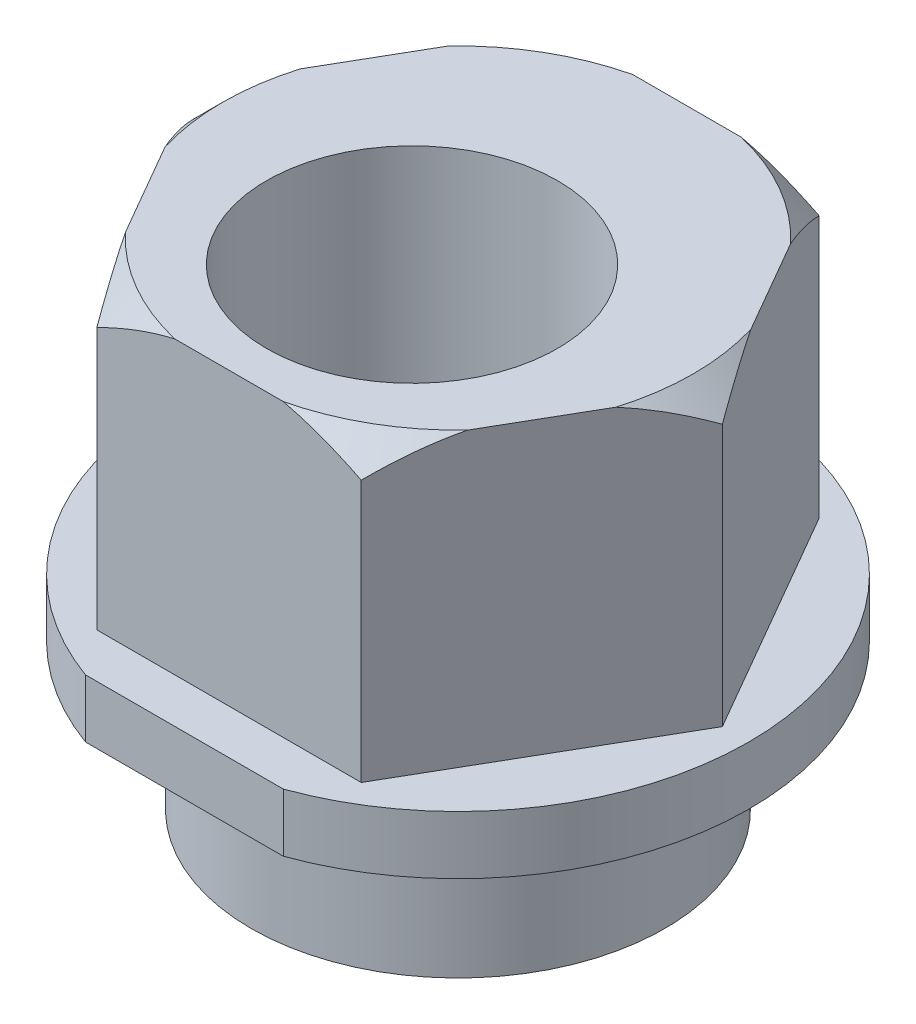
ISO-10303-21;
HEADER;
FILE_DESCRIPTION(('STEP AP214'),'2;1');
FILE_NAME('part.step','',(''),(''),'','','');
FILE_SCHEMA(('AUTOMOTIVE_DESIGN { 1 0 10303 214 1 1 1 1 }'));
ENDSEC;
DATA;
#1=APPLICATION_CONTEXT('core data for automotive mechanical design processes');
#2=APPLICATION_PROTOCOL_DEFINITION('international standard','automotive_design',2000,#1);
#3=PRODUCT_CONTEXT('',#1,'mechanical');
#4=PRODUCT('Part','Part','',(#3));
#5=PRODUCT_RELATED_PRODUCT_CATEGORY('part','',(#4));
#6=PRODUCT_DEFINITION_FORMATION('','',#4);
#7=PRODUCT_DEFINITION_CONTEXT('part definition',#1,'design');
#8=PRODUCT_DEFINITION('design','',#6,#7);
#9=PRODUCT_DEFINITION_SHAPE('','',#8);
#10=(LENGTH_UNIT() NAMED_UNIT(*) SI_UNIT(.MILLI.,.METRE.));
#11=(NAMED_UNIT(*) PLANE_ANGLE_UNIT() SI_UNIT($,.RADIAN.));
#12=(NAMED_UNIT(*) SI_UNIT($,.STERADIAN.) SOLID_ANGLE_UNIT());
#13=UNCERTAINTY_MEASURE_WITH_UNIT(LENGTH_MEASURE(1.E-05),#10,'distance_accuracy_value','');
#14=(GEOMETRIC_REPRESENTATION_CONTEXT(3) GLOBAL_UNCERTAINTY_ASSIGNED_CONTEXT((#13)) GLOBAL_UNIT_ASSIGNED_CONTEXT((#10,
#11,#12)) REPRESENTATION_CONTEXT('',''));
#15=CARTESIAN_POINT('',(0.,0.,0.));
#16=DIRECTION('',(0.,0.,1.));
#17=DIRECTION('',(1.,0.,0.));
#18=AXIS2_PLACEMENT_3D('',#15,#16,#17);
#19=CARTESIAN_POINT('',(0.,-1.,0.));
#20=DIRECTION('',(0.,1.,0.));
#21=DIRECTION('',(0.,0.,1.));
#22=AXIS2_PLACEMENT_3D('',#19,#20,#21);
#23=PLANE('',#22);
#24=CARTESIAN_POINT('',(0.,-1.,0.));
#25=DIRECTION('',(0.,1.,0.));
#26=DIRECTION('',(0.,0.,1.));
#27=AXIS2_PLACEMENT_3D('',#24,#25,#26);
#28=CIRCLE('',#27,5.);
#29=CARTESIAN_POINT('',(1.7,-1.,4.7021271782035));
#30=VERTEX_POINT('',#29);
#31=CARTESIAN_POINT('',(-1.7,-1.,4.7021271782035));
#32=VERTEX_POINT('',#31);
#33=EDGE_CURVE('E223',#30,#32,#28,.T.);
#34=ORIENTED_EDGE('',*,*,#33,.F.);
#35=DIRECTION('',(-1.,0.,0.));
#36=VECTOR('',#35,1.);
#37=CARTESIAN_POINT('',(0.,-1.,4.7021271782035));
#38=LINE('',#37,#36);
#39=EDGE_CURVE('E338',#30,#32,#38,.T.);
#40=ORIENTED_EDGE('',*,*,#39,.T.);
#41=EDGE_LOOP('',(#34,#40));
#42=FACE_BOUND('',#41,.T.);
#43=CARTESIAN_POINT('',(0.,-1.,0.));
#44=DIRECTION('',(0.,1.,0.));
#45=DIRECTION('',(0.,0.,1.));
#46=AXIS2_PLACEMENT_3D('',#43,#44,#45);
#47=CIRCLE('',#46,3.555);
#48=CARTESIAN_POINT('',(0.,-1.,3.555));
#49=VERTEX_POINT('',#48);
#50=EDGE_CURVE('E168',#49,#49,#47,.F.);
#51=ORIENTED_EDGE('',*,*,#50,.F.);
#52=EDGE_LOOP('',(#51));
#53=FACE_BOUND('',#52,.T.);
#54=ADVANCED_FACE('F36',(#42,#53),#23,.F.);
#55=CARTESIAN_POINT('',(2.27187330926118,5.,3.935));
#56=DIRECTION('',(-0.866025403784439,0.,-0.5));
#57=DIRECTION('',(-0.5,0.,0.866025403784439));
#58=AXIS2_PLACEMENT_3D('',#55,#56,#57);
#59=PLANE('',#58);
#60=DIRECTION('',(0.,-1.,0.));
#61=VECTOR('',#60,1.);
#62=CARTESIAN_POINT('',(4.54374661852235,5.,0.));
#63=LINE('',#62,#61);
#64=CARTESIAN_POINT('',(4.54374661852235,4.5,0.));
#65=VERTEX_POINT('',#64);
#66=CARTESIAN_POINT('',(4.54374661852235,0.,0.));
#67=VERTEX_POINT('',#66);
#68=EDGE_CURVE('E165',#65,#67,#63,.T.);
#69=ORIENTED_EDGE('',*,*,#68,.F.);
#70=CARTESIAN_POINT('',(6.12736327266163,2.33046829888115,-2.74290450468147));
#71=CARTESIAN_POINT('',(6.07348339276709,2.4177650828994,-2.64958181519841));
#72=CARTESIAN_POINT('',(6.01938921555573,2.50453762285222,-2.55588795187471));
#73=CARTESIAN_POINT('',(5.91069789973588,2.67683309661582,-2.36762907053321));
#74=CARTESIAN_POINT('',(5.85610071578471,2.76235591593962,-2.27306397397959));
#75=CARTESIAN_POINT('',(5.74620735938589,2.9321379387506,-2.08272309728255));
#76=CARTESIAN_POINT('',(5.6909098259844,3.01639362513631,-1.98694495989795));
#77=CARTESIAN_POINT('',(5.57966030231228,3.18315508159383,-1.79425513258));
#78=CARTESIAN_POINT('',(5.52370832991605,3.26566089928668,-1.69734347360602));
#79=CARTESIAN_POINT('',(5.40948255505868,3.43085092459455,-1.49949862801914));
#80=CARTESIAN_POINT('',(5.3511874452437,3.51347634106705,-1.3985285359868));
#81=CARTESIAN_POINT('',(5.23367321649109,3.67605365317037,-1.194987921175));
#82=CARTESIAN_POINT('',(5.17445413325307,3.75600565172091,-1.09241746022911));
#83=CARTESIAN_POINT('',(5.05499257757878,3.9125743398257,-0.885503976250002));
#84=CARTESIAN_POINT('',(4.99475102957391,3.98919384008597,-0.78116255437897));
#85=CARTESIAN_POINT('',(4.873034492307,4.1383918042904,-0.570343327711337));
#86=CARTESIAN_POINT('',(4.81155966257741,4.21097078637303,-0.463865799233039));
#87=CARTESIAN_POINT('',(4.68581480841085,4.35265115676022,-0.246069323026223));
#88=CARTESIAN_POINT('',(4.62151303943029,4.42164059850529,-0.134695392135335));
#89=CARTESIAN_POINT('',(4.4912183922476,4.55301635986169,0.090981556739347));
#90=CARTESIAN_POINT('',(4.42522527529575,4.61540174079966,0.205284988249787));
#91=CARTESIAN_POINT('',(4.29176890522431,4.73150823576122,0.436438201807242));
#92=CARTESIAN_POINT('',(4.22431561588303,4.78527468558276,0.553270726083977));
#93=CARTESIAN_POINT('',(4.08756303909753,4.88247623364584,0.790133137142428));
#94=CARTESIAN_POINT('',(4.01826431274338,4.92591443311341,0.910162052087628));
#95=CARTESIAN_POINT('',(3.89160680975576,4.99299560676046,1.129539282422));
#96=CARTESIAN_POINT('',(3.83454175212893,5.01884439579798,1.22837886156851));
#97=CARTESIAN_POINT('',(3.71955042243969,5.06126068823275,1.42754968702018));
#98=CARTESIAN_POINT('',(3.66162427680432,5.0778295405829,1.52788071434728));
#99=CARTESIAN_POINT('',(3.54536540774452,5.10083438466152,1.72924698238935));
#100=CARTESIAN_POINT('',(3.4870335640049,5.1072879053957,1.83028069944554));
#101=CARTESIAN_POINT('',(3.37031281221754,5.10976287991731,2.03244697183888));
#102=CARTESIAN_POINT('',(3.31192390350574,5.10578421082689,2.13357952832621));
#103=CARTESIAN_POINT('',(3.19571069696838,5.08764038060559,2.33486670655941));
#104=CARTESIAN_POINT('',(3.13788528988516,5.07350318473267,2.43502324959591));
#105=CARTESIAN_POINT('',(3.02300572590152,5.03579603444199,2.63400049116693));
#106=CARTESIAN_POINT('',(2.96595175572664,5.01222383709666,2.73282086628335));
#107=CARTESIAN_POINT('',(2.85271904802042,4.95661618256865,2.9289456691091));
#108=CARTESIAN_POINT('',(2.79654337792266,4.92455603960202,3.02624478386765));
#109=CARTESIAN_POINT('',(2.68537248742994,4.85318593152667,3.21879841452373));
#110=CARTESIAN_POINT('',(2.63037720983353,4.81387631861451,3.31405302949706));
#111=CARTESIAN_POINT('',(2.5019161833033,4.71383121159169,3.53655405423988));
#112=CARTESIAN_POINT('',(2.42896022795634,4.65048731772351,3.66291747561553));
#113=CARTESIAN_POINT('',(2.28511505424096,4.51496245516658,3.91206462491415));
#114=CARTESIAN_POINT('',(2.2142269607044,4.44277678394606,4.03484640457117));
#115=CARTESIAN_POINT('',(2.07416708594693,4.29140781010891,4.27743722375284));
#116=CARTESIAN_POINT('',(2.00499919286836,4.21221022636325,4.39723952881742));
#117=CARTESIAN_POINT('',(1.86828970424628,4.04847541244671,4.63402730898762));
#118=CARTESIAN_POINT('',(1.80074782327538,3.96393912900212,4.75101327846797));
#119=CARTESIAN_POINT('',(1.6667324101583,3.790255628053,4.9831347829841));
#120=CARTESIAN_POINT('',(1.60026513983173,3.70108917509827,5.09825947223014));
#121=CARTESIAN_POINT('',(1.46849790545969,3.51936003005431,5.32648701693534));
#122=CARTESIAN_POINT('',(1.40319803917282,3.42679705550268,5.43958970307165));
#123=CARTESIAN_POINT('',(1.27366225353528,3.23904020589262,5.66395226519422));
#124=CARTESIAN_POINT('',(1.20942525212282,3.14384930831284,5.77521401536649));
#125=CARTESIAN_POINT('',(1.08179181966025,2.9512386314917,5.99628160513605));
#126=CARTESIAN_POINT('',(1.01839540535985,2.85381880794148,6.10608741572204));
#127=CARTESIAN_POINT('',(0.910409016945997,2.6853578347565,6.2931253269807));
#128=CARTESIAN_POINT('',(0.865642352807006,2.61476846228915,6.3706634637548));
#129=CARTESIAN_POINT('',(0.776622094234247,2.47305833440251,6.52485107450574));
#130=CARTESIAN_POINT('',(0.732367142810404,2.40194099006958,6.60150289885833));
#131=CARTESIAN_POINT('',(0.688256655121896,2.33046829888115,6.67790450468147));
#132=B_SPLINE_CURVE_WITH_KNOTS('',3,(#70,#71,#72,#73,#74,#75,#76,#77,#78,#79,#80,#81,#82,#83,
#84,#85,#86,#87,#88,#89,#90,#91,#92,#93,#94,#95,#96,#97,#98,#99,#100,#101,#102,#103,#104,#105,
#106,#107,#108,#109,#110,#111,#112,#113,#114,#115,#116,#117,#118,#119,#120,#121,#122,#123,#124,
#125,#126,#127,#128,#129,#130,#131),.UNSPECIFIED.,.F.,.F.,(4,2,2,2,2,2,2,2,2,2,2,2,2,2,2,2,2,2,
2,2,2,2,2,2,2,2,2,2,2,2,4),(0.,0.416050988652375,0.832139855784054,1.24922530063749,
1.6662993802975,2.09496685038955,2.52361779884089,2.95189991005181,3.38012697311563,
3.81779500231414,4.25552515650994,4.69087140580247,5.12608676971888,5.4768138337239,
5.82748990199696,6.17755760407587,6.52762942952254,6.87674122143841,7.22593605499141,
7.5761578380004,7.92636261087879,8.40316579002672,8.88022366888807,9.35827656071276,
9.83624491486482,10.316388748245,10.7965726023688,11.2762330860941,11.7559031133002,
12.0979389750605,12.4385584137849),.UNSPECIFIED.);
#133=CARTESIAN_POINT('',(3.87355176865353,5.,1.1608115309438));
#134=VERTEX_POINT('',#133);
#135=EDGE_CURVE('E315',#65,#134,#132,.T.);
#136=ORIENTED_EDGE('',*,*,#135,.T.);
#137=DIRECTION('',(0.5,0.,-0.866025403784439));
#138=VECTOR('',#137,1.);
#139=CARTESIAN_POINT('',(2.27187330926118,5.,3.935));
#140=LINE('',#139,#138);
#141=CARTESIAN_POINT('',(2.94206815913,5.,2.7741884690562));
#142=VERTEX_POINT('',#141);
#143=EDGE_CURVE('E235',#142,#134,#140,.T.);
#144=ORIENTED_EDGE('',*,*,#143,.F.);
#145=CARTESIAN_POINT('',(2.27187330926118,4.5,3.935));
#146=VERTEX_POINT('',#145);
#147=EDGE_CURVE('E252',#142,#146,#132,.T.);
#148=ORIENTED_EDGE('',*,*,#147,.T.);
#149=DIRECTION('',(0.,-1.,0.));
#150=VECTOR('',#149,1.);
#151=CARTESIAN_POINT('',(2.27187330926118,5.,3.935));
#152=LINE('',#151,#150);
#153=CARTESIAN_POINT('',(2.27187330926118,0.,3.935));
#154=VERTEX_POINT('',#153);
#155=EDGE_CURVE('E219',#146,#154,#152,.T.);
#156=ORIENTED_EDGE('',*,*,#155,.T.);
#157=DIRECTION('',(0.5,0.,-0.866025403784439));
#158=VECTOR('',#157,1.);
#159=CARTESIAN_POINT('',(2.27187330926118,0.,3.935));
#160=LINE('',#159,#158);
#161=EDGE_CURVE('E220',#154,#67,#160,.T.);
#162=ORIENTED_EDGE('',*,*,#161,.T.);
#163=EDGE_LOOP('',(#69,#136,#144,#148,#156,#162));
#164=FACE_BOUND('',#163,.T.);
#165=ADVANCED_FACE('F38',(#164),#59,.F.);
#166=CARTESIAN_POINT('',(4.54374661852235,5.,0.));
#167=DIRECTION('',(-0.866025403784438,0.,0.5));
#168=DIRECTION('',(0.5,0.,0.866025403784438));
#169=AXIS2_PLACEMENT_3D('',#166,#167,#168);
#170=PLANE('',#169);
#171=DIRECTION('',(0.,-1.,0.));
#172=VECTOR('',#171,1.);
#173=CARTESIAN_POINT('',(2.27187330926118,5.,-3.935));
#174=LINE('',#173,#172);
#175=CARTESIAN_POINT('',(2.27187330926118,4.5,-3.935));
#176=VERTEX_POINT('',#175);
#177=CARTESIAN_POINT('',(2.27187330926118,0.,-3.935));
#178=VERTEX_POINT('',#177);
#179=EDGE_CURVE('E154',#176,#178,#174,.T.);
#180=ORIENTED_EDGE('',*,*,#179,.F.);
#181=CARTESIAN_POINT('',(0.688256655121894,2.33046829888116,-6.67790450468146));
#182=CARTESIAN_POINT('',(0.742136535016436,2.4177650828994,-6.58458181519841));
#183=CARTESIAN_POINT('',(0.796230712227795,2.50453762285222,-6.4908879518747));
#184=CARTESIAN_POINT('',(0.904922028047648,2.67683309661582,-6.3026290705332));
#185=CARTESIAN_POINT('',(0.959519211998818,2.76235591593963,-6.20806397397959));
#186=CARTESIAN_POINT('',(1.06941256839764,2.93213793875061,-6.01772309728255));
#187=CARTESIAN_POINT('',(1.12471010179913,3.01639362513632,-5.92194495989794));
#188=CARTESIAN_POINT('',(1.23595962547125,3.18315508159383,-5.72925513257999));
#189=CARTESIAN_POINT('',(1.29191159786749,3.26566089928668,-5.63234347360602));
#190=CARTESIAN_POINT('',(1.40613737272485,3.43085092459456,-5.43449862801913));
#191=CARTESIAN_POINT('',(1.46443248253983,3.51347634106706,-5.33352853598679));
#192=CARTESIAN_POINT('',(1.58194671129244,3.67605365317038,-5.12998792117499));
#193=CARTESIAN_POINT('',(1.64116579453046,3.75600565172092,-5.0274174602291));
#194=CARTESIAN_POINT('',(1.76062735020476,3.9125743398257,-4.82050397624999));
#195=CARTESIAN_POINT('',(1.82086889820963,3.98919384008598,-4.71616255437896));
#196=CARTESIAN_POINT('',(1.94258543547653,4.1383918042904,-4.50534332771133));
#197=CARTESIAN_POINT('',(2.00406026520612,4.21097078637303,-4.39886579923303));
#198=CARTESIAN_POINT('',(2.12980511937268,4.35265115676022,-4.18106932302621));
#199=CARTESIAN_POINT('',(2.19410688835324,4.4216405985053,-4.06969539213533));
#200=CARTESIAN_POINT('',(2.32440153553593,4.5530163598617,-3.84401844326064));
#201=CARTESIAN_POINT('',(2.39039465248778,4.61540174079966,-3.7297150117502));
#202=CARTESIAN_POINT('',(2.52385102255923,4.73150823576123,-3.49856179819275));
#203=CARTESIAN_POINT('',(2.5913043119005,4.78527468558276,-3.38172927391602));
#204=CARTESIAN_POINT('',(2.728056888686,4.88247623364584,-3.14486686285757));
#205=CARTESIAN_POINT('',(2.79735561504015,4.92591443311342,-3.02483794791237));
#206=CARTESIAN_POINT('',(2.92401311802778,4.99299560676046,-2.805460717578));
#207=CARTESIAN_POINT('',(2.98107817565461,5.01884439579799,-2.70662113843148));
#208=CARTESIAN_POINT('',(3.09606950534385,5.06126068823276,-2.50745031297981));
#209=CARTESIAN_POINT('',(3.15399565097922,5.0778295405829,-2.40711928565272));
#210=CARTESIAN_POINT('',(3.27025452003902,5.10083438466152,-2.20575301761065));
#211=CARTESIAN_POINT('',(3.32858636377864,5.1072879053957,-2.10471930055446));
#212=CARTESIAN_POINT('',(3.445307115566,5.10976287991731,-1.90255302816112));
#213=CARTESIAN_POINT('',(3.50369602427779,5.10578421082689,-1.80142047167379));
#214=CARTESIAN_POINT('',(3.61990923081515,5.08764038060559,-1.60013329344058));
#215=CARTESIAN_POINT('',(3.67773463789837,5.07350318473267,-1.49997675040409));
#216=CARTESIAN_POINT('',(3.79261420188202,5.03579603444199,-1.30099950883306));
#217=CARTESIAN_POINT('',(3.8496681720569,5.01222383709666,-1.20217913371665));
#218=CARTESIAN_POINT('',(3.96290087976311,4.95661618256865,-1.00605433089089));
#219=CARTESIAN_POINT('',(4.01907654986087,4.92455603960202,-0.908755216132345));
#220=CARTESIAN_POINT('',(4.13024744035359,4.85318593152667,-0.716201585476272));
#221=CARTESIAN_POINT('',(4.18524271795,4.81387631861451,-0.620946970502936));
#222=CARTESIAN_POINT('',(4.31370374448024,4.71383121159169,-0.398445945760117));
#223=CARTESIAN_POINT('',(4.38665969982719,4.6504873177235,-0.272082524384468));
#224=CARTESIAN_POINT('',(4.53050487354258,4.51496245516658,-0.0229353750858439));
#225=CARTESIAN_POINT('',(4.60139296707914,4.44277678394605,0.0998464045711766));
#226=CARTESIAN_POINT('',(4.74145284183661,4.2914078101089,0.342437223752842));
#227=CARTESIAN_POINT('',(4.81062073491518,4.21221022636324,0.462239528817422));
#228=CARTESIAN_POINT('',(4.94733022353726,4.0484754124467,0.699027308987622));
#229=CARTESIAN_POINT('',(5.01487210450815,3.96393912900211,0.81601327846798));
#230=CARTESIAN_POINT('',(5.14888751762524,3.79025562805299,1.04813478298411));
#231=CARTESIAN_POINT('',(5.21535478795181,3.70108917509827,1.16325947223014));
#232=CARTESIAN_POINT('',(5.34712202232385,3.5193600300543,1.39148701693534));
#233=CARTESIAN_POINT('',(5.41242188861072,3.42679705550267,1.50458970307166));
#234=CARTESIAN_POINT('',(5.54195767424825,3.23904020589262,1.72895226519422));
#235=CARTESIAN_POINT('',(5.60619467566072,3.14384930831283,1.84021401536649));
#236=CARTESIAN_POINT('',(5.73382810812329,2.95123863149169,2.06128160513606));
#237=CARTESIAN_POINT('',(5.79722452242369,2.85381880794147,2.17108741572204));
#238=CARTESIAN_POINT('',(5.90521091083754,2.68535783475649,2.3581253269807));
#239=CARTESIAN_POINT('',(5.94997757497653,2.61476846228915,2.43566346375481));
#240=CARTESIAN_POINT('',(6.03899783354929,2.47305833440251,2.58985107450574));
#241=CARTESIAN_POINT('',(6.08325278497313,2.40194099006958,2.66650289885833));
#242=CARTESIAN_POINT('',(6.12736327266164,2.33046829888115,2.74290450468146));
#243=B_SPLINE_CURVE_WITH_KNOTS('',3,(#181,#182,#183,#184,#185,#186,#187,#188,#189,#190,#191,
#192,#193,#194,#195,#196,#197,#198,#199,#200,#201,#202,#203,#204,#205,#206,#207,#208,#209,#210,
#211,#212,#213,#214,#215,#216,#217,#218,#219,#220,#221,#222,#223,#224,#225,#226,#227,#228,#229,
#230,#231,#232,#233,#234,#235,#236,#237,#238,#239,#240,#241,#242),.UNSPECIFIED.,.F.,.F.,(4,2,2,
2,2,2,2,2,2,2,2,2,2,2,2,2,2,2,2,2,2,2,2,2,2,2,2,2,2,2,4),(0.,0.416050988652376,
0.832139855784055,1.24922530063749,1.66629938029751,2.09496685038956,2.5236177988409,
2.95189991005182,3.38012697311563,3.81779500231415,4.25552515650994,4.69087140580247,
5.12608676971889,5.4768138337239,5.82748990199696,6.17755760407587,6.52762942952254,
6.87674122143841,7.22593605499141,7.57615783800039,7.92636261087879,8.40316579002672,
8.88022366888807,9.35827656071276,9.83624491486482,10.316388748245,10.7965726023688,
11.2762330860941,11.7559031133002,12.0979389750605,12.4385584137849),.UNSPECIFIED.);
#244=CARTESIAN_POINT('',(2.94206815913,5.,-2.7741884690562));
#245=VERTEX_POINT('',#244);
#246=EDGE_CURVE('E137',#176,#245,#243,.T.);
#247=ORIENTED_EDGE('',*,*,#246,.T.);
#248=DIRECTION('',(-0.5,0.,-0.866025403784438));
#249=VECTOR('',#248,1.);
#250=CARTESIAN_POINT('',(4.54374661852235,5.,0.));
#251=LINE('',#250,#249);
#252=CARTESIAN_POINT('',(3.87355176865353,5.,-1.1608115309438));
#253=VERTEX_POINT('',#252);
#254=EDGE_CURVE('E213',#253,#245,#251,.T.);
#255=ORIENTED_EDGE('',*,*,#254,.F.);
#256=EDGE_CURVE('E147',#253,#65,#243,.T.);
#257=ORIENTED_EDGE('',*,*,#256,.T.);
#258=ORIENTED_EDGE('',*,*,#68,.T.);
#259=DIRECTION('',(-0.5,0.,-0.866025403784438));
#260=VECTOR('',#259,1.);
#261=CARTESIAN_POINT('',(4.54374661852235,0.,0.));
#262=LINE('',#261,#260);
#263=EDGE_CURVE('E164',#67,#178,#262,.T.);
#264=ORIENTED_EDGE('',*,*,#263,.T.);
#265=EDGE_LOOP('',(#180,#247,#255,#257,#258,#264));
#266=FACE_BOUND('',#265,.T.);
#267=ADVANCED_FACE('F162',(#266),#170,.F.);
#268=CARTESIAN_POINT('',(2.27187330926118,5.,-3.935));
#269=DIRECTION('',(0.,0.,1.));
#270=DIRECTION('',(1.,0.,0.));
#271=AXIS2_PLACEMENT_3D('',#268,#269,#270);
#272=PLANE('',#271);
#273=DIRECTION('',(0.,-1.,0.));
#274=VECTOR('',#273,1.);
#275=CARTESIAN_POINT('',(-2.27187330926118,5.,-3.935));
#276=LINE('',#275,#274);
#277=CARTESIAN_POINT('',(-2.27187330926118,4.5,-3.935));
#278=VERTEX_POINT('',#277);
#279=CARTESIAN_POINT('',(-2.27187330926118,0.,-3.935));
#280=VERTEX_POINT('',#279);
#281=EDGE_CURVE('E166',#278,#280,#276,.T.);
#282=ORIENTED_EDGE('',*,*,#281,.F.);
#283=CARTESIAN_POINT('',(-5.01477781394264,2.6694057488158,-3.935));
#284=CARTESIAN_POINT('',(-4.90228240032233,2.75789162999437,-3.935));
#285=CARTESIAN_POINT('',(-4.78924605492269,2.84569863662638,-3.935));
#286=CARTESIAN_POINT('',(-4.56188241632701,3.01966288534844,-3.935));
#287=CARTESIAN_POINT('',(-4.44755491307628,3.10581985266844,-3.935));
#288=CARTESIAN_POINT('',(-4.21685222046402,3.27659538663721,-3.935));
#289=CARTESIAN_POINT('',(-4.10046957789372,3.36120391114583,-3.935));
#290=CARTESIAN_POINT('',(-3.86599418351296,3.52801066974508,-3.935));
#291=CARTESIAN_POINT('',(-3.74790151420127,3.61020901953759,-3.935));
#292=CARTESIAN_POINT('',(-3.50380543280417,3.77568927594522,-3.935));
#293=CARTESIAN_POINT('',(-3.3777005297054,3.85882204730453,-3.935));
#294=CARTESIAN_POINT('',(-3.12293409141574,4.0210686075328,-3.935));
#295=CARTESIAN_POINT('',(-2.99427277147477,4.10018273279293,-3.935));
#296=CARTESIAN_POINT('',(-2.7342134500717,4.25322326602883,-3.935));
#297=CARTESIAN_POINT('',(-2.60282112402671,4.32715926211431,-3.935));
#298=CARTESIAN_POINT('',(-2.33665993470769,4.46865096658867,-3.935));
#299=CARTESIAN_POINT('',(-2.20189200633557,4.53620841737975,-3.935));
#300=CARTESIAN_POINT('',(-1.94277039794665,4.65662539379787,-3.935));
#301=CARTESIAN_POINT('',(-1.81879024517606,4.7102827638368,-3.935));
#302=CARTESIAN_POINT('',(-1.56760322182998,4.80956431437058,-3.935));
#303=CARTESIAN_POINT('',(-1.4403960426367,4.8551877231961,-3.935));
#304=CARTESIAN_POINT('',(-1.18430895439847,4.93616339546024,-3.935));
#305=CARTESIAN_POINT('',(-1.05546474171029,4.97162701315895,-3.935));
#306=CARTESIAN_POINT('',(-0.795188728182397,5.03120060018271,-3.935));
#307=CARTESIAN_POINT('',(-0.663757985336443,5.05531511515621,-3.935));
#308=CARTESIAN_POINT('',(-0.39667530812576,5.09105643721047,-3.935));
#309=CARTESIAN_POINT('',(-0.260990364554486,5.10244193256667,-3.935));
#310=CARTESIAN_POINT('',(0.0108256286758382,5.11107629854814,-3.935));
#311=CARTESIAN_POINT('',(0.146956639108313,5.10832638056083,-3.935));
#312=CARTESIAN_POINT('',(0.418619878870053,5.08887050209526,-3.935));
#313=CARTESIAN_POINT('',(0.554148970208934,5.0721215602934,-3.935));
#314=CARTESIAN_POINT('',(0.822982454746628,5.02579152850102,-3.935));
#315=CARTESIAN_POINT('',(0.956286242224141,4.99620700199297,-3.935));
#316=CARTESIAN_POINT('',(1.26105655280132,4.91498323631563,-3.935));
#317=CARTESIAN_POINT('',(1.43144793684183,4.85934235740488,-3.935));
#318=CARTESIAN_POINT('',(1.76659971199313,4.73318715507506,-3.935));
#319=CARTESIAN_POINT('',(1.93135663408204,4.66266385383244,-3.935));
#320=CARTESIAN_POINT('',(2.25670464302017,4.50985567629177,-3.935));
#321=CARTESIAN_POINT('',(2.41725700907644,4.42748946751823,-3.935));
#322=CARTESIAN_POINT('',(2.7335996666453,4.25424890954647,-3.935));
#323=CARTESIAN_POINT('',(2.88939106725242,4.16337656225559,-3.935));
#324=CARTESIAN_POINT('',(3.2171018287942,3.96289685347115,-3.935));
#325=CARTESIAN_POINT('',(3.38846902004868,3.85239290462363,-3.935));
#326=CARTESIAN_POINT('',(3.7271209143155,3.62526903861077,-3.935));
#327=CARTESIAN_POINT('',(3.89440474117752,3.50864782550207,-3.935));
#328=CARTESIAN_POINT('',(4.22200861608271,3.27340163426143,-3.935));
#329=CARTESIAN_POINT('',(4.38240091884256,3.15487687320021,-3.935));
#330=CARTESIAN_POINT('',(4.6209837589724,2.97456068361506,-3.935));
#331=CARTESIAN_POINT('',(4.70015123515769,2.91405422097405,-3.935));
#332=CARTESIAN_POINT('',(4.85789331048121,2.79227931530866,-3.935));
#333=CARTESIAN_POINT('',(4.93646793238964,2.73101090179094,-3.935));
#334=CARTESIAN_POINT('',(5.01477781394264,2.6694057488158,-3.935));
#335=B_SPLINE_CURVE_WITH_KNOTS('',3,(#283,#284,#285,#286,#287,#288,#289,#290,#291,#292,#293,
#294,#295,#296,#297,#298,#299,#300,#301,#302,#303,#304,#305,#306,#307,#308,#309,#310,#311,#312,
#313,#314,#315,#316,#317,#318,#319,#320,#321,#322,#323,#324,#325,#326,#327,#328,#329,#330,#331,
#332,#333,#334),.UNSPECIFIED.,.F.,.F.,(4,2,2,2,2,2,2,2,2,2,2,2,2,2,2,2,2,2,2,2,2,2,2,2,2,4),(0.,
0.429382623340998,0.858836137877717,1.29047192805164,1.72208696325132,2.17515026344406,
2.62817557609088,3.08033856015113,3.53237766908385,3.9374314291705,4.34252407384557,
4.74299021725164,5.14329582542998,5.55106798246257,5.95880519450876,6.36779890408527,
6.77690218266532,7.31369645202257,7.85081547305105,8.39181700182992,8.932691525285,
9.54423171138721,10.15590197977,10.7541421331558,11.0530644250241,11.35197517691),.UNSPECIFIED.);
#336=CARTESIAN_POINT('',(-0.931483609523527,5.,-3.935));
#337=VERTEX_POINT('',#336);
#338=EDGE_CURVE('E159',#278,#337,#335,.T.);
#339=ORIENTED_EDGE('',*,*,#338,.T.);
#340=DIRECTION('',(-1.,0.,0.));
#341=VECTOR('',#340,1.);
#342=CARTESIAN_POINT('',(2.27187330926118,5.,-3.935));
#343=LINE('',#342,#341);
#344=CARTESIAN_POINT('',(0.931483609523526,5.,-3.935));
#345=VERTEX_POINT('',#344);
#346=EDGE_CURVE('E158',#345,#337,#343,.T.);
#347=ORIENTED_EDGE('',*,*,#346,.F.);
#348=EDGE_CURVE('E140',#345,#176,#335,.T.);
#349=ORIENTED_EDGE('',*,*,#348,.T.);
#350=ORIENTED_EDGE('',*,*,#179,.T.);
#351=DIRECTION('',(-1.,0.,0.));
#352=VECTOR('',#351,1.);
#353=CARTESIAN_POINT('',(2.27187330926118,0.,-3.935));
#354=LINE('',#353,#352);
#355=EDGE_CURVE('E225',#178,#280,#354,.T.);
#356=ORIENTED_EDGE('',*,*,#355,.T.);
#357=EDGE_LOOP('',(#282,#339,#347,#349,#350,#356));
#358=FACE_BOUND('',#357,.T.);
#359=ADVANCED_FACE('F152',(#358),#272,.F.);
#360=CARTESIAN_POINT('',(-2.27187330926118,5.,-3.935));
#361=DIRECTION('',(0.866025403784438,0.,0.5));
#362=DIRECTION('',(0.5,0.,-0.866025403784439));
#363=AXIS2_PLACEMENT_3D('',#360,#361,#362);
#364=PLANE('',#363);
#365=DIRECTION('',(0.,-1.,0.));
#366=VECTOR('',#365,1.);
#367=CARTESIAN_POINT('',(-4.54374661852235,5.,0.));
#368=LINE('',#367,#366);
#369=CARTESIAN_POINT('',(-4.54374661852235,4.5,0.));
#370=VERTEX_POINT('',#369);
#371=CARTESIAN_POINT('',(-4.54374661852235,0.,0.));
#372=VERTEX_POINT('',#371);
#373=EDGE_CURVE('E170',#370,#372,#368,.T.);
#374=ORIENTED_EDGE('',*,*,#373,.F.);
#375=CARTESIAN_POINT('',(-6.12736327266164,2.33046829888115,2.74290450468147));
#376=CARTESIAN_POINT('',(-6.07348339276709,2.4177650828994,2.64958181519841));
#377=CARTESIAN_POINT('',(-6.01938921555574,2.50453762285222,2.5558879518747));
#378=CARTESIAN_POINT('',(-5.91069789973588,2.67683309661582,2.3676290705332));
#379=CARTESIAN_POINT('',(-5.85610071578471,2.76235591593963,2.27306397397959));
#380=CARTESIAN_POINT('',(-5.74620735938589,2.9321379387506,2.08272309728255));
#381=CARTESIAN_POINT('',(-5.6909098259844,3.01639362513631,1.98694495989795));
#382=CARTESIAN_POINT('',(-5.57966030231228,3.18315508159383,1.79425513257999));
#383=CARTESIAN_POINT('',(-5.52370832991604,3.26566089928668,1.69734347360602));
#384=CARTESIAN_POINT('',(-5.40948255505868,3.43085092459455,1.49949862801913));
#385=CARTESIAN_POINT('',(-5.3511874452437,3.51347634106705,1.39852853598679));
#386=CARTESIAN_POINT('',(-5.23367321649109,3.67605365317037,1.19498792117499));
#387=CARTESIAN_POINT('',(-5.17445413325307,3.75600565172092,1.0924174602291));
#388=CARTESIAN_POINT('',(-5.05499257757878,3.9125743398257,0.885503976249998));
#389=CARTESIAN_POINT('',(-4.99475102957391,3.98919384008598,0.781162554378965));
#390=CARTESIAN_POINT('',(-4.873034492307,4.1383918042904,0.570343327711332));
#391=CARTESIAN_POINT('',(-4.81155966257741,4.21097078637303,0.463865799233036));
#392=CARTESIAN_POINT('',(-4.68581480841085,4.35265115676022,0.24606932302622));
#393=CARTESIAN_POINT('',(-4.62151303943029,4.42164059850529,0.134695392135332));
#394=CARTESIAN_POINT('',(-4.4912183922476,4.55301635986169,-0.0909815567393509));
#395=CARTESIAN_POINT('',(-4.42522527529575,4.61540174079966,-0.205284988249791));
#396=CARTESIAN_POINT('',(-4.2917689052243,4.73150823576122,-0.436438201807246));
#397=CARTESIAN_POINT('',(-4.22431561588303,4.78527468558276,-0.553270726083981));
#398=CARTESIAN_POINT('',(-4.08756303909753,4.88247623364584,-0.790133137142432));
#399=CARTESIAN_POINT('',(-4.01826431274338,4.92591443311341,-0.910162052087631));
#400=CARTESIAN_POINT('',(-3.89160680975576,4.99299560676046,-1.129539282422));
#401=CARTESIAN_POINT('',(-3.83454175212893,5.01884439579798,-1.22837886156851));
#402=CARTESIAN_POINT('',(-3.71955042243968,5.06126068823275,-1.42754968702018));
#403=CARTESIAN_POINT('',(-3.66162427680432,5.0778295405829,-1.52788071434728));
#404=CARTESIAN_POINT('',(-3.54536540774451,5.10083438466152,-1.72924698238935));
#405=CARTESIAN_POINT('',(-3.48703356400489,5.1072879053957,-1.83028069944554));
#406=CARTESIAN_POINT('',(-3.37031281221754,5.10976287991731,-2.03244697183888));
#407=CARTESIAN_POINT('',(-3.31192390350574,5.10578421082689,-2.13357952832621));
#408=CARTESIAN_POINT('',(-3.19571069696838,5.08764038060559,-2.33486670655941));
#409=CARTESIAN_POINT('',(-3.13788528988516,5.07350318473267,-2.43502324959591));
#410=CARTESIAN_POINT('',(-3.02300572590152,5.03579603444199,-2.63400049116693));
#411=CARTESIAN_POINT('',(-2.96595175572664,5.01222383709666,-2.73282086628335));
#412=CARTESIAN_POINT('',(-2.85271904802042,4.95661618256865,-2.9289456691091));
#413=CARTESIAN_POINT('',(-2.79654337792266,4.92455603960202,-3.02624478386765));
#414=CARTESIAN_POINT('',(-2.68537248742994,4.85318593152667,-3.21879841452372));
#415=CARTESIAN_POINT('',(-2.63037720983353,4.81387631861451,-3.31405302949706));
#416=CARTESIAN_POINT('',(-2.5019161833033,4.71383121159169,-3.53655405423988));
#417=CARTESIAN_POINT('',(-2.42896022795634,4.65048731772351,-3.66291747561553));
#418=CARTESIAN_POINT('',(-2.28511505424096,4.51496245516658,-3.91206462491415));
#419=CARTESIAN_POINT('',(-2.21422696070439,4.44277678394606,-4.03484640457117));
#420=CARTESIAN_POINT('',(-2.07416708594693,4.29140781010891,-4.27743722375283));
#421=CARTESIAN_POINT('',(-2.00499919286836,4.21221022636325,-4.39723952881741));
#422=CARTESIAN_POINT('',(-1.86828970424628,4.04847541244671,-4.63402730898761));
#423=CARTESIAN_POINT('',(-1.80074782327538,3.96393912900212,-4.75101327846797));
#424=CARTESIAN_POINT('',(-1.6667324101583,3.790255628053,-4.9831347829841));
#425=CARTESIAN_POINT('',(-1.60026513983173,3.70108917509828,-5.09825947223013));
#426=CARTESIAN_POINT('',(-1.46849790545969,3.51936003005432,-5.32648701693533));
#427=CARTESIAN_POINT('',(-1.40319803917282,3.42679705550269,-5.43958970307165));
#428=CARTESIAN_POINT('',(-1.27366225353529,3.23904020589263,-5.66395226519421));
#429=CARTESIAN_POINT('',(-1.20942525212282,3.14384930831284,-5.77521401536648));
#430=CARTESIAN_POINT('',(-1.08179181966026,2.95123863149171,-5.99628160513604));
#431=CARTESIAN_POINT('',(-1.01839540535985,2.85381880794148,-6.10608741572203));
#432=CARTESIAN_POINT('',(-0.910409016945998,2.68535783475651,-6.29312532698069));
#433=CARTESIAN_POINT('',(-0.865642352807006,2.61476846228916,-6.3706634637548));
#434=CARTESIAN_POINT('',(-0.776622094234247,2.47305833440251,-6.52485107450573));
#435=CARTESIAN_POINT('',(-0.732367142810403,2.40194099006959,-6.60150289885832));
#436=CARTESIAN_POINT('',(-0.688256655121894,2.33046829888116,-6.67790450468146));
#437=B_SPLINE_CURVE_WITH_KNOTS('',3,(#375,#376,#377,#378,#379,#380,#381,#382,#383,#384,#385,
#386,#387,#388,#389,#390,#391,#392,#393,#394,#395,#396,#397,#398,#399,#400,#401,#402,#403,#404,
#405,#406,#407,#408,#409,#410,#411,#412,#413,#414,#415,#416,#417,#418,#419,#420,#421,#422,#423,
#424,#425,#426,#427,#428,#429,#430,#431,#432,#433,#434,#435,#436),.UNSPECIFIED.,.F.,.F.,(4,2,2,
2,2,2,2,2,2,2,2,2,2,2,2,2,2,2,2,2,2,2,2,2,2,2,2,2,2,2,4),(0.,0.416050988652376,
0.832139855784055,1.24922530063749,1.66629938029751,2.09496685038956,2.5236177988409,
2.95189991005181,3.38012697311563,3.81779500231415,4.25552515650994,4.69087140580247,
5.12608676971889,5.4768138337239,5.82748990199696,6.17755760407587,6.52762942952254,
6.87674122143841,7.22593605499141,7.57615783800039,7.92636261087879,8.40316579002672,
8.88022366888806,9.35827656071275,9.83624491486481,10.316388748245,10.7965726023688,
11.276233086094,11.7559031133002,12.0979389750605,12.4385584137849),.UNSPECIFIED.);
#438=CARTESIAN_POINT('',(-3.87355176865353,5.,-1.1608115309438));
#439=VERTEX_POINT('',#438);
#440=EDGE_CURVE('E193',#370,#439,#437,.T.);
#441=ORIENTED_EDGE('',*,*,#440,.T.);
#442=DIRECTION('',(-0.5,0.,0.866025403784439));
#443=VECTOR('',#442,1.);
#444=CARTESIAN_POINT('',(-2.27187330926118,5.,-3.935));
#445=LINE('',#444,#443);
#446=CARTESIAN_POINT('',(-2.94206815913,5.,-2.7741884690562));
#447=VERTEX_POINT('',#446);
#448=EDGE_CURVE('E203',#447,#439,#445,.T.);
#449=ORIENTED_EDGE('',*,*,#448,.F.);
#450=EDGE_CURVE('E205',#447,#278,#437,.T.);
#451=ORIENTED_EDGE('',*,*,#450,.T.);
#452=ORIENTED_EDGE('',*,*,#281,.T.);
#453=DIRECTION('',(-0.5,0.,0.866025403784439));
#454=VECTOR('',#453,1.);
#455=CARTESIAN_POINT('',(-2.27187330926118,0.,-3.935));
#456=LINE('',#455,#454);
#457=EDGE_CURVE('E227',#280,#372,#456,.T.);
#458=ORIENTED_EDGE('',*,*,#457,.T.);
#459=EDGE_LOOP('',(#374,#441,#449,#451,#452,#458));
#460=FACE_BOUND('',#459,.T.);
#461=ADVANCED_FACE('F201',(#460),#364,.F.);
#462=CARTESIAN_POINT('',(-4.54374661852235,5.,0.));
#463=DIRECTION('',(0.866025403784438,0.,-0.5));
#464=DIRECTION('',(-0.5,0.,-0.866025403784439));
#465=AXIS2_PLACEMENT_3D('',#462,#463,#464);
#466=PLANE('',#465);
#467=DIRECTION('',(0.,-1.,0.));
#468=VECTOR('',#467,1.);
#469=CARTESIAN_POINT('',(-2.27187330926118,5.,3.935));
#470=LINE('',#469,#468);
#471=CARTESIAN_POINT('',(-2.27187330926118,4.5,3.935));
#472=VERTEX_POINT('',#471);
#473=CARTESIAN_POINT('',(-2.27187330926118,0.,3.935));
#474=VERTEX_POINT('',#473);
#475=EDGE_CURVE('E237',#472,#474,#470,.T.);
#476=ORIENTED_EDGE('',*,*,#475,.F.);
#477=CARTESIAN_POINT('',(-0.688256655121893,2.33046829888115,6.67790450468147));
#478=CARTESIAN_POINT('',(-0.742136535016436,2.4177650828994,6.58458181519841));
#479=CARTESIAN_POINT('',(-0.796230712227795,2.50453762285222,6.4908879518747));
#480=CARTESIAN_POINT('',(-0.904922028047647,2.67683309661582,6.3026290705332));
#481=CARTESIAN_POINT('',(-0.959519211998818,2.76235591593963,6.20806397397959));
#482=CARTESIAN_POINT('',(-1.06941256839764,2.9321379387506,6.01772309728255));
#483=CARTESIAN_POINT('',(-1.12471010179913,3.01639362513631,5.92194495989795));
#484=CARTESIAN_POINT('',(-1.23595962547125,3.18315508159383,5.72925513257999));
#485=CARTESIAN_POINT('',(-1.29191159786748,3.26566089928668,5.63234347360602));
#486=CARTESIAN_POINT('',(-1.40613737272485,3.43085092459455,5.43449862801913));
#487=CARTESIAN_POINT('',(-1.46443248253983,3.51347634106705,5.33352853598679));
#488=CARTESIAN_POINT('',(-1.58194671129244,3.67605365317037,5.12998792117499));
#489=CARTESIAN_POINT('',(-1.64116579453046,3.75600565172092,5.0274174602291));
#490=CARTESIAN_POINT('',(-1.76062735020475,3.9125743398257,4.82050397625));
#491=CARTESIAN_POINT('',(-1.82086889820962,3.98919384008598,4.71616255437897));
#492=CARTESIAN_POINT('',(-1.94258543547653,4.1383918042904,4.50534332771133));
#493=CARTESIAN_POINT('',(-2.00406026520612,4.21097078637303,4.39886579923304));
#494=CARTESIAN_POINT('',(-2.12980511937268,4.35265115676022,4.18106932302622));
#495=CARTESIAN_POINT('',(-2.19410688835324,4.42164059850529,4.06969539213533));
#496=CARTESIAN_POINT('',(-2.32440153553593,4.55301635986169,3.84401844326065));
#497=CARTESIAN_POINT('',(-2.39039465248778,4.61540174079966,3.72971501175021));
#498=CARTESIAN_POINT('',(-2.52385102255923,4.73150823576122,3.49856179819275));
#499=CARTESIAN_POINT('',(-2.5913043119005,4.78527468558276,3.38172927391602));
#500=CARTESIAN_POINT('',(-2.728056888686,4.88247623364584,3.14486686285757));
#501=CARTESIAN_POINT('',(-2.79735561504015,4.92591443311341,3.02483794791237));
#502=CARTESIAN_POINT('',(-2.92401311802777,4.99299560676046,2.805460717578));
#503=CARTESIAN_POINT('',(-2.9810781756546,5.01884439579798,2.70662113843149));
#504=CARTESIAN_POINT('',(-3.09606950534385,5.06126068823275,2.50745031297982));
#505=CARTESIAN_POINT('',(-3.15399565097921,5.0778295405829,2.40711928565272));
#506=CARTESIAN_POINT('',(-3.27025452003902,5.10083438466152,2.20575301761065));
#507=CARTESIAN_POINT('',(-3.32858636377864,5.1072879053957,2.10471930055446));
#508=CARTESIAN_POINT('',(-3.44530711556599,5.10976287991731,1.90255302816112));
#509=CARTESIAN_POINT('',(-3.50369602427779,5.10578421082689,1.80142047167379));
#510=CARTESIAN_POINT('',(-3.61990923081515,5.08764038060559,1.60013329344058));
#511=CARTESIAN_POINT('',(-3.67773463789837,5.07350318473267,1.49997675040409));
#512=CARTESIAN_POINT('',(-3.79261420188201,5.03579603444199,1.30099950883306));
#513=CARTESIAN_POINT('',(-3.84966817205689,5.01222383709666,1.20217913371665));
#514=CARTESIAN_POINT('',(-3.96290087976311,4.95661618256865,1.0060543308909));
#515=CARTESIAN_POINT('',(-4.01907654986087,4.92455603960202,0.908755216132348));
#516=CARTESIAN_POINT('',(-4.13024744035359,4.85318593152667,0.716201585476275));
#517=CARTESIAN_POINT('',(-4.18524271795,4.81387631861451,0.620946970502938));
#518=CARTESIAN_POINT('',(-4.31370374448024,4.71383121159169,0.39844594576012));
#519=CARTESIAN_POINT('',(-4.38665969982719,4.65048731772351,0.272082524384471));
#520=CARTESIAN_POINT('',(-4.53050487354258,4.51496245516658,0.0229353750858478));
#521=CARTESIAN_POINT('',(-4.60139296707914,4.44277678394605,-0.0998464045711718));
#522=CARTESIAN_POINT('',(-4.7414528418366,4.2914078101089,-0.342437223752836));
#523=CARTESIAN_POINT('',(-4.81062073491518,4.21221022636325,-0.462239528817416));
#524=CARTESIAN_POINT('',(-4.94733022353725,4.04847541244671,-0.699027308987616));
#525=CARTESIAN_POINT('',(-5.01487210450815,3.96393912900212,-0.816013278467974));
#526=CARTESIAN_POINT('',(-5.14888751762524,3.790255628053,-1.0481347829841));
#527=CARTESIAN_POINT('',(-5.21535478795181,3.70108917509827,-1.16325947223014));
#528=CARTESIAN_POINT('',(-5.34712202232384,3.51936003005431,-1.39148701693534));
#529=CARTESIAN_POINT('',(-5.41242188861071,3.42679705550268,-1.50458970307165));
#530=CARTESIAN_POINT('',(-5.54195767424825,3.23904020589263,-1.72895226519421));
#531=CARTESIAN_POINT('',(-5.60619467566072,3.14384930831284,-1.84021401536648));
#532=CARTESIAN_POINT('',(-5.73382810812328,2.9512386314917,-2.06128160513605));
#533=CARTESIAN_POINT('',(-5.79722452242368,2.85381880794148,-2.17108741572204));
#534=CARTESIAN_POINT('',(-5.90521091083754,2.6853578347565,-2.3581253269807));
#535=CARTESIAN_POINT('',(-5.94997757497653,2.61476846228915,-2.4356634637548));
#536=CARTESIAN_POINT('',(-6.03899783354928,2.47305833440251,-2.58985107450574));
#537=CARTESIAN_POINT('',(-6.08325278497313,2.40194099006958,-2.66650289885833));
#538=CARTESIAN_POINT('',(-6.12736327266164,2.33046829888115,-2.74290450468146));
#539=B_SPLINE_CURVE_WITH_KNOTS('',3,(#477,#478,#479,#480,#481,#482,#483,#484,#485,#486,#487,
#488,#489,#490,#491,#492,#493,#494,#495,#496,#497,#498,#499,#500,#501,#502,#503,#504,#505,#506,
#507,#508,#509,#510,#511,#512,#513,#514,#515,#516,#517,#518,#519,#520,#521,#522,#523,#524,#525,
#526,#527,#528,#529,#530,#531,#532,#533,#534,#535,#536,#537,#538),.UNSPECIFIED.,.F.,.F.,(4,2,2,
2,2,2,2,2,2,2,2,2,2,2,2,2,2,2,2,2,2,2,2,2,2,2,2,2,2,2,4),(0.,0.416050988652376,
0.832139855784055,1.24922530063749,1.66629938029751,2.09496685038956,2.5236177988409,
2.95189991005181,3.38012697311563,3.81779500231415,4.25552515650994,4.69087140580247,
5.12608676971889,5.4768138337239,5.82748990199696,6.17755760407587,6.52762942952254,
6.87674122143841,7.22593605499141,7.5761578380004,7.92636261087879,8.40316579002672,
8.88022366888807,9.35827656071275,9.83624491486482,10.316388748245,10.7965726023688,
11.2762330860941,11.7559031133002,12.0979389750605,12.4385584137849),.UNSPECIFIED.);
#540=CARTESIAN_POINT('',(-2.94206815913,5.,2.7741884690562));
#541=VERTEX_POINT('',#540);
#542=EDGE_CURVE('E258',#472,#541,#539,.T.);
#543=ORIENTED_EDGE('',*,*,#542,.T.);
#544=DIRECTION('',(0.5,0.,0.866025403784439));
#545=VECTOR('',#544,1.);
#546=CARTESIAN_POINT('',(-4.54374661852235,5.,0.));
#547=LINE('',#546,#545);
#548=CARTESIAN_POINT('',(-3.87355176865353,5.,1.16081153094381));
#549=VERTEX_POINT('',#548);
#550=EDGE_CURVE('E209',#549,#541,#547,.T.);
#551=ORIENTED_EDGE('',*,*,#550,.F.);
#552=EDGE_CURVE('E60',#549,#370,#539,.T.);
#553=ORIENTED_EDGE('',*,*,#552,.T.);
#554=ORIENTED_EDGE('',*,*,#373,.T.);
#555=DIRECTION('',(0.5,0.,0.866025403784439));
#556=VECTOR('',#555,1.);
#557=CARTESIAN_POINT('',(-4.54374661852235,0.,0.));
#558=LINE('',#557,#556);
#559=EDGE_CURVE('E229',#372,#474,#558,.T.);
#560=ORIENTED_EDGE('',*,*,#559,.T.);
#561=EDGE_LOOP('',(#476,#543,#551,#553,#554,#560));
#562=FACE_BOUND('',#561,.T.);
#563=ADVANCED_FACE('F241',(#562),#466,.F.);
#564=CARTESIAN_POINT('',(-2.27187330926118,5.,3.935));
#565=DIRECTION('',(0.,0.,-1.));
#566=DIRECTION('',(-1.,0.,0.));
#567=AXIS2_PLACEMENT_3D('',#564,#565,#566);
#568=PLANE('',#567);
#569=ORIENTED_EDGE('',*,*,#155,.F.);
#570=CARTESIAN_POINT('',(5.01477781394264,2.6694057488158,3.935));
#571=CARTESIAN_POINT('',(4.90228240032233,2.75789162999437,3.935));
#572=CARTESIAN_POINT('',(4.78924605492269,2.84569863662638,3.935));
#573=CARTESIAN_POINT('',(4.56188241632702,3.01966288534844,3.935));
#574=CARTESIAN_POINT('',(4.44755491307628,3.10581985266844,3.935));
#575=CARTESIAN_POINT('',(4.21685222046402,3.2765953866372,3.935));
#576=CARTESIAN_POINT('',(4.10046957789372,3.36120391114583,3.935));
#577=CARTESIAN_POINT('',(3.86599418351296,3.52801066974507,3.935));
#578=CARTESIAN_POINT('',(3.74790151420128,3.61020901953759,3.935));
#579=CARTESIAN_POINT('',(3.50380543280417,3.77568927594521,3.935));
#580=CARTESIAN_POINT('',(3.3777005297054,3.85882204730453,3.935));
#581=CARTESIAN_POINT('',(3.12293409141574,4.0210686075328,3.935));
#582=CARTESIAN_POINT('',(2.99427277147477,4.10018273279292,3.935));
#583=CARTESIAN_POINT('',(2.73421345007169,4.25322326602883,3.935));
#584=CARTESIAN_POINT('',(2.6028211240267,4.32715926211431,3.935));
#585=CARTESIAN_POINT('',(2.33665993470769,4.46865096658866,3.935));
#586=CARTESIAN_POINT('',(2.20189200633557,4.53620841737975,3.935));
#587=CARTESIAN_POINT('',(1.94277039794665,4.65662539379787,3.935));
#588=CARTESIAN_POINT('',(1.81879024517606,4.7102827638368,3.935));
#589=CARTESIAN_POINT('',(1.56760322182998,4.80956431437058,3.935));
#590=CARTESIAN_POINT('',(1.4403960426367,4.8551877231961,3.935));
#591=CARTESIAN_POINT('',(1.18430895439847,4.93616339546023,3.935));
#592=CARTESIAN_POINT('',(1.05546474171029,4.97162701315895,3.935));
#593=CARTESIAN_POINT('',(0.795188728182395,5.03120060018271,3.935));
#594=CARTESIAN_POINT('',(0.663757985336441,5.05531511515621,3.935));
#595=CARTESIAN_POINT('',(0.396675308125757,5.09105643721046,3.935));
#596=CARTESIAN_POINT('',(0.260990364554484,5.10244193256667,3.935));
#597=CARTESIAN_POINT('',(-0.0108256286758407,5.11107629854814,3.935));
#598=CARTESIAN_POINT('',(-0.146956639108315,5.10832638056083,3.935));
#599=CARTESIAN_POINT('',(-0.418619878870055,5.08887050209526,3.935));
#600=CARTESIAN_POINT('',(-0.554148970208936,5.07212156029339,3.935));
#601=CARTESIAN_POINT('',(-0.82298245474663,5.02579152850101,3.935));
#602=CARTESIAN_POINT('',(-0.956286242224143,4.99620700199297,3.935));
#603=CARTESIAN_POINT('',(-1.26105655280132,4.91498323631563,3.935));
#604=CARTESIAN_POINT('',(-1.43144793684184,4.85934235740488,3.935));
#605=CARTESIAN_POINT('',(-1.76659971199313,4.73318715507506,3.935));
#606=CARTESIAN_POINT('',(-1.93135663408205,4.66266385383244,3.935));
#607=CARTESIAN_POINT('',(-2.25670464302018,4.50985567629176,3.935));
#608=CARTESIAN_POINT('',(-2.41725700907645,4.42748946751823,3.935));
#609=CARTESIAN_POINT('',(-2.73359966664531,4.25424890954647,3.935));
#610=CARTESIAN_POINT('',(-2.88939106725242,4.16337656225559,3.935));
#611=CARTESIAN_POINT('',(-3.2171018287942,3.96289685347115,3.935));
#612=CARTESIAN_POINT('',(-3.38846902004868,3.85239290462363,3.935));
#613=CARTESIAN_POINT('',(-3.7271209143155,3.62526903861077,3.935));
#614=CARTESIAN_POINT('',(-3.89440474117752,3.50864782550207,3.935));
#615=CARTESIAN_POINT('',(-4.22200861608271,3.27340163426143,3.935));
#616=CARTESIAN_POINT('',(-4.38240091884256,3.15487687320021,3.935));
#617=CARTESIAN_POINT('',(-4.6209837589724,2.97456068361506,3.935));
#618=CARTESIAN_POINT('',(-4.70015123515769,2.91405422097405,3.935));
#619=CARTESIAN_POINT('',(-4.85789331048121,2.79227931530866,3.935));
#620=CARTESIAN_POINT('',(-4.93646793238964,2.73101090179094,3.935));
#621=CARTESIAN_POINT('',(-5.01477781394264,2.6694057488158,3.935));
#622=B_SPLINE_CURVE_WITH_KNOTS('',3,(#570,#571,#572,#573,#574,#575,#576,#577,#578,#579,#580,
#581,#582,#583,#584,#585,#586,#587,#588,#589,#590,#591,#592,#593,#594,#595,#596,#597,#598,#599,
#600,#601,#602,#603,#604,#605,#606,#607,#608,#609,#610,#611,#612,#613,#614,#615,#616,#617,#618,
#619,#620,#621),.UNSPECIFIED.,.F.,.F.,(4,2,2,2,2,2,2,2,2,2,2,2,2,2,2,2,2,2,2,2,2,2,2,2,2,4),(0.,
0.429382623340998,0.858836137877717,1.29047192805164,1.72208696325132,2.17515026344406,
2.62817557609088,3.08033856015113,3.53237766908385,3.93743142917051,4.34252407384557,
4.74299021725164,5.14329582542998,5.55106798246258,5.95880519450876,6.36779890408527,
6.77690218266532,7.31369645202258,7.85081547305105,8.39181700182993,8.93269152528501,
9.54423171138722,10.15590197977,10.7541421331558,11.0530644250241,11.35197517691),.UNSPECIFIED.);
#623=CARTESIAN_POINT('',(0.931483609523519,5.,3.935));
#624=VERTEX_POINT('',#623);
#625=EDGE_CURVE('E256',#146,#624,#622,.T.);
#626=ORIENTED_EDGE('',*,*,#625,.T.);
#627=DIRECTION('',(1.,0.,0.));
#628=VECTOR('',#627,1.);
#629=CARTESIAN_POINT('',(-2.27187330926118,5.,3.935));
#630=LINE('',#629,#628);
#631=CARTESIAN_POINT('',(-0.931483609523519,5.,3.935));
#632=VERTEX_POINT('',#631);
#633=EDGE_CURVE('E211',#632,#624,#630,.T.);
#634=ORIENTED_EDGE('',*,*,#633,.F.);
#635=EDGE_CURVE('E52',#632,#472,#622,.T.);
#636=ORIENTED_EDGE('',*,*,#635,.T.);
#637=ORIENTED_EDGE('',*,*,#475,.T.);
#638=DIRECTION('',(1.,0.,0.));
#639=VECTOR('',#638,1.);
#640=CARTESIAN_POINT('',(-2.27187330926118,0.,3.935));
#641=LINE('',#640,#639);
#642=EDGE_CURVE('E232',#474,#154,#641,.T.);
#643=ORIENTED_EDGE('',*,*,#642,.T.);
#644=EDGE_LOOP('',(#569,#626,#634,#636,#637,#643));
#645=FACE_BOUND('',#644,.T.);
#646=ADVANCED_FACE('F254',(#645),#568,.F.);
#647=CARTESIAN_POINT('',(0.,5.,0.));
#648=DIRECTION('',(0.,1.,0.));
#649=DIRECTION('',(0.,0.,1.));
#650=AXIS2_PLACEMENT_3D('',#647,#648,#649);
#651=PLANE('',#650);
#652=CARTESIAN_POINT('',(0.,5.,0.));
#653=DIRECTION('',(0.,1.,0.));
#654=DIRECTION('',(0.,0.,1.));
#655=AXIS2_PLACEMENT_3D('',#652,#653,#654);
#656=CIRCLE('',#655,4.04374661852235);
#657=EDGE_CURVE('E11',#632,#541,#656,.F.);
#658=ORIENTED_EDGE('',*,*,#657,.F.);
#659=ORIENTED_EDGE('',*,*,#633,.T.);
#660=EDGE_CURVE('E41',#142,#624,#656,.F.);
#661=ORIENTED_EDGE('',*,*,#660,.F.);
#662=ORIENTED_EDGE('',*,*,#143,.T.);
#663=EDGE_CURVE('E181',#253,#134,#656,.F.);
#664=ORIENTED_EDGE('',*,*,#663,.F.);
#665=ORIENTED_EDGE('',*,*,#254,.T.);
#666=CARTESIAN_POINT('',(0.,5.,0.));
#667=DIRECTION('',(0.,-1.,0.));
#668=DIRECTION('',(0.,0.,-1.));
#669=AXIS2_PLACEMENT_3D('',#666,#667,#668);
#670=CIRCLE('',#669,4.04374661852235);
#671=EDGE_CURVE('E142',#345,#245,#670,.T.);
#672=ORIENTED_EDGE('',*,*,#671,.F.);
#673=ORIENTED_EDGE('',*,*,#346,.T.);
#674=EDGE_CURVE('E185',#447,#337,#656,.F.);
#675=ORIENTED_EDGE('',*,*,#674,.F.);
#676=ORIENTED_EDGE('',*,*,#448,.T.);
#677=EDGE_CURVE('E46',#549,#439,#656,.F.);
#678=ORIENTED_EDGE('',*,*,#677,.F.);
#679=ORIENTED_EDGE('',*,*,#550,.T.);
#680=EDGE_LOOP('',(#658,#659,#661,#662,#664,#665,#672,#673,#675,#676,#678,#679));
#681=FACE_BOUND('',#680,.T.);
#682=CARTESIAN_POINT('',(0.,5.,0.79));
#683=DIRECTION('',(0.,1.,0.));
#684=DIRECTION('',(0.,0.,1.));
#685=AXIS2_PLACEMENT_3D('',#682,#683,#684);
#686=CIRCLE('',#685,2.5);
#687=CARTESIAN_POINT('',(0.,5.,3.29));
#688=VERTEX_POINT('',#687);
#689=EDGE_CURVE('E340',#688,#688,#686,.T.);
#690=ORIENTED_EDGE('',*,*,#689,.F.);
#691=EDGE_LOOP('',(#690));
#692=FACE_BOUND('',#691,.T.);
#693=ADVANCED_FACE('F207',(#681,#692),#651,.T.);
#694=CARTESIAN_POINT('',(0.,0.,0.));
#695=DIRECTION('',(0.,1.,0.));
#696=DIRECTION('',(0.,0.,1.));
#697=AXIS2_PLACEMENT_3D('',#694,#695,#696);
#698=PLANE('',#697);
#699=DIRECTION('',(-1.,0.,0.));
#700=VECTOR('',#699,1.);
#701=CARTESIAN_POINT('',(-1.7,0.,4.7021271782035));
#702=LINE('',#701,#700);
#703=CARTESIAN_POINT('',(1.7,0.,4.7021271782035));
#704=VERTEX_POINT('',#703);
#705=CARTESIAN_POINT('',(-1.7,0.,4.7021271782035));
#706=VERTEX_POINT('',#705);
#707=EDGE_CURVE('E336',#704,#706,#702,.T.);
#708=ORIENTED_EDGE('',*,*,#707,.F.);
#709=CARTESIAN_POINT('',(0.,0.,0.));
#710=DIRECTION('',(0.,1.,0.));
#711=DIRECTION('',(0.,0.,1.));
#712=AXIS2_PLACEMENT_3D('',#709,#710,#711);
#713=CIRCLE('',#712,5.);
#714=EDGE_CURVE('E349',#704,#706,#713,.T.);
#715=ORIENTED_EDGE('',*,*,#714,.T.);
#716=EDGE_LOOP('',(#708,#715));
#717=FACE_BOUND('',#716,.T.);
#718=ORIENTED_EDGE('',*,*,#161,.F.);
#719=ORIENTED_EDGE('',*,*,#642,.F.);
#720=ORIENTED_EDGE('',*,*,#559,.F.);
#721=ORIENTED_EDGE('',*,*,#457,.F.);
#722=ORIENTED_EDGE('',*,*,#355,.F.);
#723=ORIENTED_EDGE('',*,*,#263,.F.);
#724=EDGE_LOOP('',(#718,#719,#720,#721,#722,#723));
#725=FACE_BOUND('',#724,.T.);
#726=ADVANCED_FACE('F246',(#717,#725),#698,.T.);
#727=CARTESIAN_POINT('',(0.,-1.,0.));
#728=DIRECTION('',(0.,1.,0.));
#729=DIRECTION('',(0.,0.,1.));
#730=AXIS2_PLACEMENT_3D('',#727,#728,#729);
#731=CYLINDRICAL_SURFACE('',#730,5.);
#732=DIRECTION('',(0.,1.,0.));
#733=VECTOR('',#732,1.);
#734=CARTESIAN_POINT('',(-1.7,-1.,4.7021271782035));
#735=LINE('',#734,#733);
#736=EDGE_CURVE('E177',#706,#32,#735,.F.);
#737=ORIENTED_EDGE('',*,*,#736,.F.);
#738=ORIENTED_EDGE('',*,*,#714,.F.);
#739=DIRECTION('',(0.,1.,0.));
#740=VECTOR('',#739,1.);
#741=CARTESIAN_POINT('',(1.7,-1.,4.7021271782035));
#742=LINE('',#741,#740);
#743=EDGE_CURVE('E176',#30,#704,#742,.T.);
#744=ORIENTED_EDGE('',*,*,#743,.F.);
#745=ORIENTED_EDGE('',*,*,#33,.T.);
#746=EDGE_LOOP('',(#737,#738,#744,#745));
#747=FACE_BOUND('',#746,.T.);
#748=ADVANCED_FACE('F288',(#747),#731,.T.);
#749=CARTESIAN_POINT('',(0.,-3.5,0.));
#750=DIRECTION('',(0.,1.,0.));
#751=DIRECTION('',(0.,0.,1.));
#752=AXIS2_PLACEMENT_3D('',#749,#750,#751);
#753=CYLINDRICAL_SURFACE('',#752,3.555);
#754=CARTESIAN_POINT('',(0.,-3.5,0.));
#755=DIRECTION('',(0.,-1.,0.));
#756=DIRECTION('',(0.,0.,-1.));
#757=AXIS2_PLACEMENT_3D('',#754,#755,#756);
#758=CIRCLE('',#757,3.555);
#759=CARTESIAN_POINT('',(0.,-3.5,-3.555));
#760=VERTEX_POINT('',#759);
#761=EDGE_CURVE('E344',#760,#760,#758,.T.);
#762=ORIENTED_EDGE('',*,*,#761,.F.);
#763=EDGE_LOOP('',(#762));
#764=FACE_BOUND('',#763,.T.);
#765=ORIENTED_EDGE('',*,*,#50,.T.);
#766=EDGE_LOOP('',(#765));
#767=FACE_BOUND('',#766,.T.);
#768=ADVANCED_FACE('F284',(#764,#767),#753,.T.);
#769=CARTESIAN_POINT('',(0.,-3.5,0.));
#770=DIRECTION('',(0.,-1.,0.));
#771=DIRECTION('',(0.,0.,-1.));
#772=AXIS2_PLACEMENT_3D('',#769,#770,#771);
#773=PLANE('',#772);
#774=CARTESIAN_POINT('',(0.,-3.5,0.79));
#775=DIRECTION('',(0.,1.,0.));
#776=DIRECTION('',(0.,0.,1.));
#777=AXIS2_PLACEMENT_3D('',#774,#775,#776);
#778=CIRCLE('',#777,2.5);
#779=CARTESIAN_POINT('',(0.,-3.5,3.29));
#780=VERTEX_POINT('',#779);
#781=EDGE_CURVE('E341',#780,#780,#778,.T.);
#782=ORIENTED_EDGE('',*,*,#781,.T.);
#783=EDGE_LOOP('',(#782));
#784=FACE_BOUND('',#783,.T.);
#785=ORIENTED_EDGE('',*,*,#761,.T.);
#786=EDGE_LOOP('',(#785));
#787=FACE_BOUND('',#786,.T.);
#788=ADVANCED_FACE('F364',(#784,#787),#773,.T.);
#789=CARTESIAN_POINT('',(0.,-3.5,0.79));
#790=DIRECTION('',(0.,1.,0.));
#791=DIRECTION('',(0.,0.,1.));
#792=AXIS2_PLACEMENT_3D('',#789,#790,#791);
#793=CYLINDRICAL_SURFACE('',#792,2.5);
#794=ORIENTED_EDGE('',*,*,#781,.F.);
#795=EDGE_LOOP('',(#794));
#796=FACE_BOUND('',#795,.T.);
#797=ORIENTED_EDGE('',*,*,#689,.T.);
#798=EDGE_LOOP('',(#797));
#799=FACE_BOUND('',#798,.T.);
#800=ADVANCED_FACE('F360',(#796,#799),#793,.F.);
#801=CARTESIAN_POINT('',(-1.7,-3.5,4.7021271782035));
#802=DIRECTION('',(0.,0.,-1.));
#803=DIRECTION('',(-1.,0.,0.));
#804=AXIS2_PLACEMENT_3D('',#801,#802,#803);
#805=PLANE('',#804);
#806=ORIENTED_EDGE('',*,*,#743,.T.);
#807=ORIENTED_EDGE('',*,*,#707,.T.);
#808=ORIENTED_EDGE('',*,*,#736,.T.);
#809=ORIENTED_EDGE('',*,*,#39,.F.);
#810=EDGE_LOOP('',(#806,#807,#808,#809));
#811=FACE_BOUND('',#810,.T.);
#812=ADVANCED_FACE('F273',(#811),#805,.F.);
#813=CARTESIAN_POINT('',(0.,5.,0.));
#814=DIRECTION('',(0.,-1.,0.));
#815=DIRECTION('',(0.,0.,-1.));
#816=AXIS2_PLACEMENT_3D('',#813,#814,#815);
#817=CONICAL_SURFACE('',#816,4.04374661852235,0.785398163397448);
#818=ORIENTED_EDGE('',*,*,#660,.T.);
#819=ORIENTED_EDGE('',*,*,#625,.F.);
#820=ORIENTED_EDGE('',*,*,#147,.F.);
#821=EDGE_LOOP('',(#818,#819,#820));
#822=FACE_BOUND('',#821,.T.);
#823=ADVANCED_FACE('F264',(#822),#817,.T.);
#824=ORIENTED_EDGE('',*,*,#256,.F.);
#825=ORIENTED_EDGE('',*,*,#663,.T.);
#826=ORIENTED_EDGE('',*,*,#135,.F.);
#827=EDGE_LOOP('',(#824,#825,#826));
#828=FACE_BOUND('',#827,.T.);
#829=ADVANCED_FACE('F263',(#828),#817,.T.);
#830=ORIENTED_EDGE('',*,*,#348,.F.);
#831=ORIENTED_EDGE('',*,*,#671,.T.);
#832=ORIENTED_EDGE('',*,*,#246,.F.);
#833=EDGE_LOOP('',(#830,#831,#832));
#834=FACE_BOUND('',#833,.T.);
#835=ADVANCED_FACE('F139',(#834),#817,.T.);
#836=ORIENTED_EDGE('',*,*,#450,.F.);
#837=ORIENTED_EDGE('',*,*,#674,.T.);
#838=ORIENTED_EDGE('',*,*,#338,.F.);
#839=EDGE_LOOP('',(#836,#837,#838));
#840=FACE_BOUND('',#839,.T.);
#841=ADVANCED_FACE('F268',(#840),#817,.T.);
#842=ORIENTED_EDGE('',*,*,#552,.F.);
#843=ORIENTED_EDGE('',*,*,#677,.T.);
#844=ORIENTED_EDGE('',*,*,#440,.F.);
#845=EDGE_LOOP('',(#842,#843,#844));
#846=FACE_BOUND('',#845,.T.);
#847=ADVANCED_FACE('F192',(#846),#817,.T.);
#848=ORIENTED_EDGE('',*,*,#635,.F.);
#849=ORIENTED_EDGE('',*,*,#657,.T.);
#850=ORIENTED_EDGE('',*,*,#542,.F.);
#851=EDGE_LOOP('',(#848,#849,#850));
#852=FACE_BOUND('',#851,.T.);
#853=ADVANCED_FACE('F260',(#852),#817,.T.);
#854=CLOSED_SHELL('',(#54,#165,#267,#359,#461,#563,#646,#693,#726,#748,#768,#788,#800,#812,#823,
#829,#835,#841,#847,#853));
#855=MANIFOLD_SOLID_BREP('B2',#854);
#856=ADVANCED_BREP_SHAPE_REPRESENTATION('',(#18,#855),#14);
#857=SHAPE_DEFINITION_REPRESENTATION(#9,#856);
ENDSEC;
END-ISO-10303-21;
